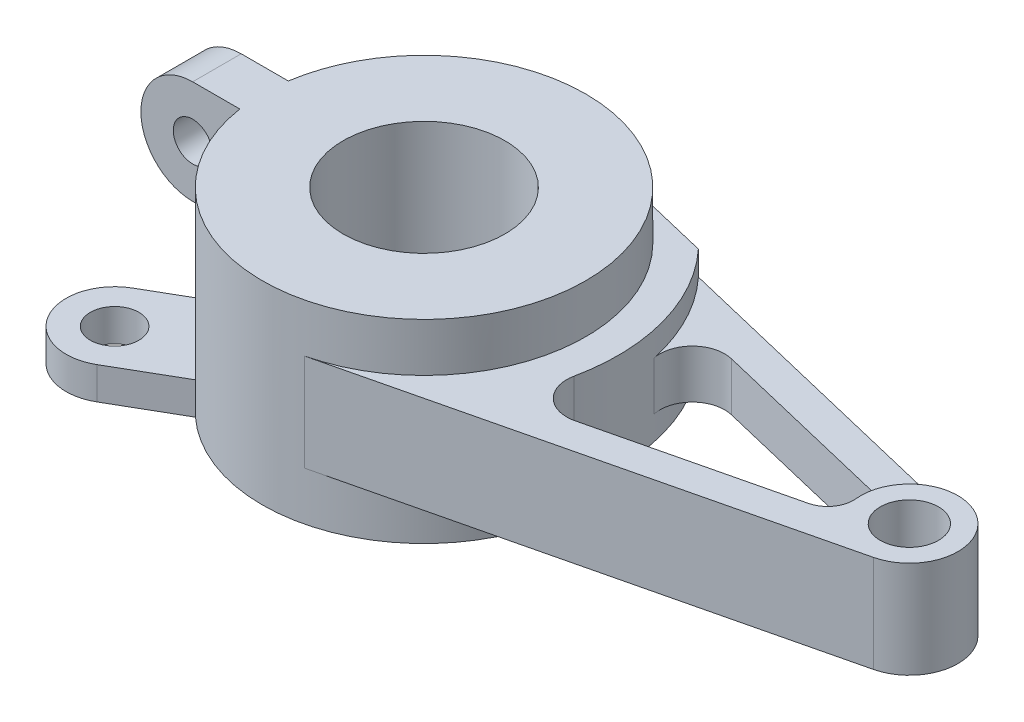
ISO-10303-21;
HEADER;
FILE_DESCRIPTION(('STEP AP214'),'2;1');
FILE_NAME('part.step','',(''),(''),'','','');
FILE_SCHEMA(('AUTOMOTIVE_DESIGN { 1 0 10303 214 1 1 1 1 }'));
ENDSEC;
DATA;
#1=APPLICATION_CONTEXT('core data for automotive mechanical design processes');
#2=APPLICATION_PROTOCOL_DEFINITION('international standard','automotive_design',2000,#1);
#3=PRODUCT_CONTEXT('',#1,'mechanical');
#4=PRODUCT('Part','Part','',(#3));
#5=PRODUCT_RELATED_PRODUCT_CATEGORY('part','',(#4));
#6=PRODUCT_DEFINITION_FORMATION('','',#4);
#7=PRODUCT_DEFINITION_CONTEXT('part definition',#1,'design');
#8=PRODUCT_DEFINITION('design','',#6,#7);
#9=PRODUCT_DEFINITION_SHAPE('','',#8);
#10=(LENGTH_UNIT() NAMED_UNIT(*) SI_UNIT(.MILLI.,.METRE.));
#11=(NAMED_UNIT(*) PLANE_ANGLE_UNIT() SI_UNIT($,.RADIAN.));
#12=(NAMED_UNIT(*) SI_UNIT($,.STERADIAN.) SOLID_ANGLE_UNIT());
#13=UNCERTAINTY_MEASURE_WITH_UNIT(LENGTH_MEASURE(1.E-05),#10,'distance_accuracy_value','');
#14=(GEOMETRIC_REPRESENTATION_CONTEXT(3) GLOBAL_UNCERTAINTY_ASSIGNED_CONTEXT((#13)) GLOBAL_UNIT_ASSIGNED_CONTEXT((#10,
#11,#12)) REPRESENTATION_CONTEXT('',''));
#15=CARTESIAN_POINT('',(0.,0.,0.));
#16=DIRECTION('',(0.,0.,1.));
#17=DIRECTION('',(1.,0.,0.));
#18=AXIS2_PLACEMENT_3D('',#15,#16,#17);
#19=CARTESIAN_POINT('',(-64.,14.,7.5));
#20=DIRECTION('',(0.,0.,1.));
#21=DIRECTION('',(0.,-1.,0.));
#22=AXIS2_PLACEMENT_3D('',#19,#20,#21);
#23=CYLINDRICAL_SURFACE('',#22,16.);
#24=DIRECTION('',(0.,0.,-1.));
#25=VECTOR('',#24,1.);
#26=CARTESIAN_POINT('',(-64.,-2.,7.5));
#27=LINE('',#26,#25);
#28=CARTESIAN_POINT('',(-64.,-2.,7.5));
#29=VERTEX_POINT('',#28);
#30=CARTESIAN_POINT('',(-64.,-2.,-7.50000000000001));
#31=VERTEX_POINT('',#30);
#32=EDGE_CURVE('E430',#29,#31,#27,.T.);
#33=ORIENTED_EDGE('',*,*,#32,.F.);
#34=CARTESIAN_POINT('',(-64.,14.,7.5));
#35=DIRECTION('',(0.,0.,-1.));
#36=DIRECTION('',(0.,1.,0.));
#37=AXIS2_PLACEMENT_3D('',#34,#35,#36);
#38=CIRCLE('',#37,16.);
#39=CARTESIAN_POINT('',(-64.,30.,7.5));
#40=VERTEX_POINT('',#39);
#41=EDGE_CURVE('E47',#40,#29,#38,.F.);
#42=ORIENTED_EDGE('',*,*,#41,.F.);
#43=DIRECTION('',(0.,0.,-1.));
#44=VECTOR('',#43,1.);
#45=CARTESIAN_POINT('',(-64.,30.,7.5));
#46=LINE('',#45,#44);
#47=CARTESIAN_POINT('',(-64.,30.,-7.5));
#48=VERTEX_POINT('',#47);
#49=EDGE_CURVE('E434',#48,#40,#46,.F.);
#50=ORIENTED_EDGE('',*,*,#49,.F.);
#51=CARTESIAN_POINT('',(-64.,14.,-7.5));
#52=DIRECTION('',(0.,0.,-1.));
#53=DIRECTION('',(0.,1.,0.));
#54=AXIS2_PLACEMENT_3D('',#51,#52,#53);
#55=CIRCLE('',#54,16.);
#56=EDGE_CURVE('E11',#31,#48,#55,.T.);
#57=ORIENTED_EDGE('',*,*,#56,.F.);
#58=EDGE_LOOP('',(#33,#42,#50,#57));
#59=FACE_BOUND('',#58,.T.);
#60=ADVANCED_FACE('F38',(#59),#23,.T.);
#61=CARTESIAN_POINT('',(0.,30.,0.));
#62=DIRECTION('',(0.,-1.,0.));
#63=DIRECTION('',(0.,0.,-1.));
#64=AXIS2_PLACEMENT_3D('',#61,#62,#63);
#65=CYLINDRICAL_SURFACE('',#64,50.);
#66=DIRECTION('',(0.,-1.,0.));
#67=VECTOR('',#66,1.);
#68=CARTESIAN_POINT('',(-48.8067791046457,-20.,-10.8580989786571));
#69=LINE('',#68,#67);
#70=CARTESIAN_POINT('',(-48.8067791046457,-20.,-10.8580989786571));
#71=VERTEX_POINT('',#70);
#72=CARTESIAN_POINT('',(-48.8067791046458,-30.,-10.8580989786571));
#73=VERTEX_POINT('',#72);
#74=EDGE_CURVE('E268',#71,#73,#69,.T.);
#75=ORIENTED_EDGE('',*,*,#74,.T.);
#76=CARTESIAN_POINT('',(0.,-30.,0.));
#77=DIRECTION('',(0.,1.,0.));
#78=DIRECTION('',(0.,0.,1.));
#79=AXIS2_PLACEMENT_3D('',#76,#77,#78);
#80=CIRCLE('',#79,50.);
#81=CARTESIAN_POINT('',(-48.8067791046457,-30.,10.8580989786571));
#82=VERTEX_POINT('',#81);
#83=EDGE_CURVE('E426',#73,#82,#80,.T.);
#84=ORIENTED_EDGE('',*,*,#83,.T.);
#85=DIRECTION('',(0.,-1.,0.));
#86=VECTOR('',#85,1.);
#87=CARTESIAN_POINT('',(-48.8067791046457,-20.,10.8580989786571));
#88=LINE('',#87,#86);
#89=CARTESIAN_POINT('',(-48.8067791046458,-20.,10.8580989786571));
#90=VERTEX_POINT('',#89);
#91=EDGE_CURVE('E307',#90,#82,#88,.T.);
#92=ORIENTED_EDGE('',*,*,#91,.F.);
#93=CARTESIAN_POINT('',(0.,-20.,0.));
#94=DIRECTION('',(0.,1.,0.));
#95=DIRECTION('',(0.,0.,-1.));
#96=AXIS2_PLACEMENT_3D('',#93,#94,#95);
#97=CIRCLE('',#96,50.);
#98=CARTESIAN_POINT('',(-33.8067791046457,-20.,36.8388610921903));
#99=VERTEX_POINT('',#98);
#100=EDGE_CURVE('E288',#90,#99,#97,.T.);
#101=ORIENTED_EDGE('',*,*,#100,.T.);
#102=DIRECTION('',(0.,-1.,0.));
#103=VECTOR('',#102,1.);
#104=CARTESIAN_POINT('',(-33.8067791046457,-20.,36.8388610921903));
#105=LINE('',#104,#103);
#106=CARTESIAN_POINT('',(-33.8067791046457,-30.,36.8388610921903));
#107=VERTEX_POINT('',#106);
#108=EDGE_CURVE('E304',#99,#107,#105,.T.);
#109=ORIENTED_EDGE('',*,*,#108,.T.);
#110=CARTESIAN_POINT('',(-33.8067791046457,-30.,-36.8388610921903));
#111=VERTEX_POINT('',#110);
#112=EDGE_CURVE('E431',#107,#111,#80,.T.);
#113=ORIENTED_EDGE('',*,*,#112,.T.);
#114=DIRECTION('',(0.,-1.,0.));
#115=VECTOR('',#114,1.);
#116=CARTESIAN_POINT('',(-33.8067791046457,-20.,-36.8388610921903));
#117=LINE('',#116,#115);
#118=CARTESIAN_POINT('',(-33.8067791046457,-20.,-36.8388610921903));
#119=VERTEX_POINT('',#118);
#120=EDGE_CURVE('E270',#119,#111,#117,.T.);
#121=ORIENTED_EDGE('',*,*,#120,.F.);
#122=CARTESIAN_POINT('',(0.,-20.,0.));
#123=DIRECTION('',(0.,-1.,0.));
#124=DIRECTION('',(0.,0.,1.));
#125=AXIS2_PLACEMENT_3D('',#122,#123,#124);
#126=CIRCLE('',#125,50.);
#127=EDGE_CURVE('E251',#71,#119,#126,.T.);
#128=ORIENTED_EDGE('',*,*,#127,.F.);
#129=EDGE_LOOP('',(#75,#84,#92,#101,#109,#113,#121,#128));
#130=FACE_BOUND('',#129,.T.);
#131=CARTESIAN_POINT('',(0.,15.,0.));
#132=DIRECTION('',(0.,-1.,0.));
#133=DIRECTION('',(0.,0.,1.));
#134=AXIS2_PLACEMENT_3D('',#131,#132,#133);
#135=CIRCLE('',#134,50.);
#136=CARTESIAN_POINT('',(11.6666666666667,15.,-48.6198404860494));
#137=VERTEX_POINT('',#136);
#138=CARTESIAN_POINT('',(11.6666666666667,15.,48.6198404860494));
#139=VERTEX_POINT('',#138);
#140=EDGE_CURVE('E370',#137,#139,#135,.T.);
#141=ORIENTED_EDGE('',*,*,#140,.F.);
#142=DIRECTION('',(0.,-1.,0.));
#143=VECTOR('',#142,1.);
#144=CARTESIAN_POINT('',(11.6666666666667,15.,-48.6198404860494));
#145=LINE('',#144,#143);
#146=CARTESIAN_POINT('',(11.6666666666667,-15.,-48.6198404860494));
#147=VERTEX_POINT('',#146);
#148=EDGE_CURVE('E413',#137,#147,#145,.T.);
#149=ORIENTED_EDGE('',*,*,#148,.T.);
#150=CARTESIAN_POINT('',(0.,-15.,0.));
#151=DIRECTION('',(0.,-1.,0.));
#152=DIRECTION('',(0.,0.,1.));
#153=AXIS2_PLACEMENT_3D('',#150,#151,#152);
#154=CIRCLE('',#153,50.);
#155=CARTESIAN_POINT('',(11.6666666666667,-15.,48.6198404860494));
#156=VERTEX_POINT('',#155);
#157=EDGE_CURVE('E390',#147,#156,#154,.T.);
#158=ORIENTED_EDGE('',*,*,#157,.T.);
#159=DIRECTION('',(0.,-1.,0.));
#160=VECTOR('',#159,1.);
#161=CARTESIAN_POINT('',(11.6666666666667,15.,48.6198404860494));
#162=LINE('',#161,#160);
#163=EDGE_CURVE('E410',#139,#156,#162,.T.);
#164=ORIENTED_EDGE('',*,*,#163,.F.);
#165=EDGE_LOOP('',(#141,#149,#158,#164));
#166=FACE_BOUND('',#165,.T.);
#167=DIRECTION('',(0.,-1.,0.));
#168=VECTOR('',#167,1.);
#169=CARTESIAN_POINT('',(-49.434299833213,30.,7.5));
#170=LINE('',#169,#168);
#171=CARTESIAN_POINT('',(-49.434299833213,30.,7.5));
#172=VERTEX_POINT('',#171);
#173=CARTESIAN_POINT('',(-49.434299833213,-2.,7.5));
#174=VERTEX_POINT('',#173);
#175=EDGE_CURVE('E220',#172,#174,#170,.T.);
#176=ORIENTED_EDGE('',*,*,#175,.T.);
#177=CARTESIAN_POINT('',(0.,-2.,0.));
#178=DIRECTION('',(0.,-1.,0.));
#179=DIRECTION('',(0.,0.,-1.));
#180=AXIS2_PLACEMENT_3D('',#177,#178,#179);
#181=CIRCLE('',#180,50.);
#182=CARTESIAN_POINT('',(-49.434299833213,-2.,-7.50000000000001));
#183=VERTEX_POINT('',#182);
#184=EDGE_CURVE('E210',#183,#174,#181,.F.);
#185=ORIENTED_EDGE('',*,*,#184,.F.);
#186=DIRECTION('',(0.,-1.,0.));
#187=VECTOR('',#186,1.);
#188=CARTESIAN_POINT('',(-49.434299833213,30.,-7.5));
#189=LINE('',#188,#187);
#190=CARTESIAN_POINT('',(-49.434299833213,30.,-7.5));
#191=VERTEX_POINT('',#190);
#192=EDGE_CURVE('E219',#191,#183,#189,.T.);
#193=ORIENTED_EDGE('',*,*,#192,.F.);
#194=CARTESIAN_POINT('',(0.,30.,0.));
#195=DIRECTION('',(0.,1.,0.));
#196=DIRECTION('',(0.,0.,1.));
#197=AXIS2_PLACEMENT_3D('',#194,#195,#196);
#198=CIRCLE('',#197,50.);
#199=EDGE_CURVE('E231',#172,#191,#198,.T.);
#200=ORIENTED_EDGE('',*,*,#199,.F.);
#201=EDGE_LOOP('',(#176,#185,#193,#200));
#202=FACE_BOUND('',#201,.T.);
#203=ADVANCED_FACE('F229',(#130,#166,#202),#65,.T.);
#204=CARTESIAN_POINT('',(0.,30.,0.));
#205=DIRECTION('',(0.,1.,0.));
#206=DIRECTION('',(0.,0.,1.));
#207=AXIS2_PLACEMENT_3D('',#204,#205,#206);
#208=PLANE('',#207);
#209=DIRECTION('',(-1.,0.,0.));
#210=VECTOR('',#209,1.);
#211=CARTESIAN_POINT('',(165.002,30.,-7.5));
#212=LINE('',#211,#210);
#213=EDGE_CURVE('E244',#191,#48,#212,.T.);
#214=ORIENTED_EDGE('',*,*,#213,.T.);
#215=ORIENTED_EDGE('',*,*,#49,.T.);
#216=DIRECTION('',(-1.,0.,0.));
#217=VECTOR('',#216,1.);
#218=CARTESIAN_POINT('',(165.002,30.,7.5));
#219=LINE('',#218,#217);
#220=EDGE_CURVE('E227',#172,#40,#219,.T.);
#221=ORIENTED_EDGE('',*,*,#220,.F.);
#222=ORIENTED_EDGE('',*,*,#199,.T.);
#223=EDGE_LOOP('',(#214,#215,#221,#222));
#224=FACE_BOUND('',#223,.T.);
#225=CARTESIAN_POINT('',(0.,30.,0.));
#226=DIRECTION('',(0.,1.,0.));
#227=DIRECTION('',(0.,0.,1.));
#228=AXIS2_PLACEMENT_3D('',#225,#226,#227);
#229=CIRCLE('',#228,25.);
#230=CARTESIAN_POINT('',(0.,30.,25.));
#231=VERTEX_POINT('',#230);
#232=EDGE_CURVE('E423',#231,#231,#229,.T.);
#233=ORIENTED_EDGE('',*,*,#232,.F.);
#234=EDGE_LOOP('',(#233));
#235=FACE_BOUND('',#234,.T.);
#236=ADVANCED_FACE('F438',(#224,#235),#208,.T.);
#237=CARTESIAN_POINT('',(0.,-30.,0.));
#238=DIRECTION('',(0.,1.,0.));
#239=DIRECTION('',(0.,0.,1.));
#240=AXIS2_PLACEMENT_3D('',#237,#238,#239);
#241=PLANE('',#240);
#242=ORIENTED_EDGE('',*,*,#112,.F.);
#243=DIRECTION('',(-0.866025403784438,0.,0.500000000000001));
#244=VECTOR('',#243,1.);
#245=CARTESIAN_POINT('',(-53.1217782649107,-30.,47.9903810567666));
#246=LINE('',#245,#244);
#247=CARTESIAN_POINT('',(-53.1217782649107,-30.,47.9903810567666));
#248=VERTEX_POINT('',#247);
#249=EDGE_CURVE('E285',#107,#248,#246,.T.);
#250=ORIENTED_EDGE('',*,*,#249,.T.);
#251=CARTESIAN_POINT('',(-60.6217782649107,-30.,35.0000000000001));
#252=DIRECTION('',(0.,-1.,0.));
#253=DIRECTION('',(0.,0.,-1.));
#254=AXIS2_PLACEMENT_3D('',#251,#252,#253);
#255=CIRCLE('',#254,15.);
#256=CARTESIAN_POINT('',(-68.1217782649107,-30.,22.0096189432335));
#257=VERTEX_POINT('',#256);
#258=EDGE_CURVE('E278',#248,#257,#255,.T.);
#259=ORIENTED_EDGE('',*,*,#258,.T.);
#260=DIRECTION('',(0.866025403784438,0.,-0.500000000000001));
#261=VECTOR('',#260,1.);
#262=CARTESIAN_POINT('',(-68.1217782649107,-30.,22.0096189432335));
#263=LINE('',#262,#261);
#264=EDGE_CURVE('E296',#257,#82,#263,.T.);
#265=ORIENTED_EDGE('',*,*,#264,.T.);
#266=ORIENTED_EDGE('',*,*,#83,.F.);
#267=DIRECTION('',(0.866025403784438,0.,0.500000000000001));
#268=VECTOR('',#267,1.);
#269=CARTESIAN_POINT('',(-68.1217782649107,-30.,-22.0096189432335));
#270=LINE('',#269,#268);
#271=CARTESIAN_POINT('',(-68.1217782649107,-30.,-22.0096189432335));
#272=VERTEX_POINT('',#271);
#273=EDGE_CURVE('E249',#272,#73,#270,.T.);
#274=ORIENTED_EDGE('',*,*,#273,.F.);
#275=CARTESIAN_POINT('',(-60.6217782649107,-30.,-35.0000000000001));
#276=DIRECTION('',(0.,1.,0.));
#277=DIRECTION('',(0.,0.,1.));
#278=AXIS2_PLACEMENT_3D('',#275,#276,#277);
#279=CIRCLE('',#278,15.);
#280=CARTESIAN_POINT('',(-53.1217782649107,-30.,-47.9903810567666));
#281=VERTEX_POINT('',#280);
#282=EDGE_CURVE('E240',#281,#272,#279,.T.);
#283=ORIENTED_EDGE('',*,*,#282,.F.);
#284=DIRECTION('',(-0.866025403784438,0.,-0.500000000000001));
#285=VECTOR('',#284,1.);
#286=CARTESIAN_POINT('',(-53.1217782649107,-30.,-47.9903810567666));
#287=LINE('',#286,#285);
#288=EDGE_CURVE('E260',#111,#281,#287,.T.);
#289=ORIENTED_EDGE('',*,*,#288,.F.);
#290=EDGE_LOOP('',(#242,#250,#259,#265,#266,#274,#283,#289));
#291=FACE_BOUND('',#290,.T.);
#292=CARTESIAN_POINT('',(0.,-30.,0.));
#293=DIRECTION('',(0.,1.,0.));
#294=DIRECTION('',(0.,0.,1.));
#295=AXIS2_PLACEMENT_3D('',#292,#293,#294);
#296=CIRCLE('',#295,25.);
#297=CARTESIAN_POINT('',(0.,-30.,25.));
#298=VERTEX_POINT('',#297);
#299=EDGE_CURVE('E422',#298,#298,#296,.T.);
#300=ORIENTED_EDGE('',*,*,#299,.T.);
#301=EDGE_LOOP('',(#300));
#302=FACE_BOUND('',#301,.T.);
#303=CARTESIAN_POINT('',(-60.6217782649107,-30.,35.0000000000001));
#304=DIRECTION('',(0.,-1.,0.));
#305=DIRECTION('',(0.,0.,-1.));
#306=AXIS2_PLACEMENT_3D('',#303,#304,#305);
#307=CIRCLE('',#306,7.50000000000001);
#308=CARTESIAN_POINT('',(-60.6217782649107,-30.,27.5));
#309=VERTEX_POINT('',#308);
#310=EDGE_CURVE('E267',#309,#309,#307,.T.);
#311=ORIENTED_EDGE('',*,*,#310,.F.);
#312=EDGE_LOOP('',(#311));
#313=FACE_BOUND('',#312,.T.);
#314=CARTESIAN_POINT('',(-60.6217782649107,-30.,-35.0000000000001));
#315=DIRECTION('',(0.,1.,0.));
#316=DIRECTION('',(0.,0.,1.));
#317=AXIS2_PLACEMENT_3D('',#314,#315,#316);
#318=CIRCLE('',#317,7.50000000000001);
#319=CARTESIAN_POINT('',(-60.6217782649107,-30.,-27.5));
#320=VERTEX_POINT('',#319);
#321=EDGE_CURVE('E241',#320,#320,#318,.T.);
#322=ORIENTED_EDGE('',*,*,#321,.T.);
#323=EDGE_LOOP('',(#322));
#324=FACE_BOUND('',#323,.T.);
#325=ADVANCED_FACE('F471',(#291,#302,#313,#324),#241,.F.);
#326=CARTESIAN_POINT('',(0.,30.,0.));
#327=DIRECTION('',(0.,-1.,0.));
#328=DIRECTION('',(0.,0.,-1.));
#329=AXIS2_PLACEMENT_3D('',#326,#327,#328);
#330=CYLINDRICAL_SURFACE('',#329,25.);
#331=ORIENTED_EDGE('',*,*,#232,.T.);
#332=EDGE_LOOP('',(#331));
#333=FACE_BOUND('',#332,.T.);
#334=ORIENTED_EDGE('',*,*,#299,.F.);
#335=EDGE_LOOP('',(#334));
#336=FACE_BOUND('',#335,.T.);
#337=ADVANCED_FACE('F476',(#333,#336),#330,.F.);
#338=CARTESIAN_POINT('',(68.4997741639936,15.,14.4146085441772));
#339=DIRECTION('',(0.,1.,0.));
#340=DIRECTION('',(0.,0.,1.));
#341=AXIS2_PLACEMENT_3D('',#338,#339,#340);
#342=PLANE('',#341);
#343=CARTESIAN_POINT('',(68.4997741639936,15.,14.4146085441772));
#344=DIRECTION('',(0.,-1.,0.));
#345=DIRECTION('',(0.,0.,1.));
#346=AXIS2_PLACEMENT_3D('',#343,#344,#345);
#347=CIRCLE('',#346,9.99999999999999);
#348=CARTESIAN_POINT('',(70.833107497327,15.,24.1385766413871));
#349=VERTEX_POINT('',#348);
#350=CARTESIAN_POINT('',(58.714092140566,15.,12.3553787521519));
#351=VERTEX_POINT('',#350);
#352=EDGE_CURVE('E361',#349,#351,#347,.T.);
#353=ORIENTED_EDGE('',*,*,#352,.T.);
#354=CARTESIAN_POINT('',(0.,15.,0.));
#355=DIRECTION('',(0.,1.,0.));
#356=DIRECTION('',(0.,0.,1.));
#357=AXIS2_PLACEMENT_3D('',#354,#355,#356);
#358=CIRCLE('',#357,60.);
#359=CARTESIAN_POINT('',(43.917420318498,15.,-40.8810493085535));
#360=VERTEX_POINT('',#359);
#361=EDGE_CURVE('E364',#351,#360,#358,.T.);
#362=ORIENTED_EDGE('',*,*,#361,.T.);
#363=DIRECTION('',(-0.972396809720988,0.,-0.233333333333333));
#364=VECTOR('',#363,1.);
#365=CARTESIAN_POINT('',(43.917420318498,15.,-40.8810493085535));
#366=LINE('',#365,#364);
#367=EDGE_CURVE('E367',#360,#137,#366,.T.);
#368=ORIENTED_EDGE('',*,*,#367,.T.);
#369=ORIENTED_EDGE('',*,*,#140,.T.);
#370=DIRECTION('',(0.972396809720988,0.,-0.233333333333333));
#371=VECTOR('',#370,1.);
#372=CARTESIAN_POINT('',(153.5,15.,14.5859521458148));
#373=LINE('',#372,#371);
#374=CARTESIAN_POINT('',(153.5,15.,14.5859521458148));
#375=VERTEX_POINT('',#374);
#376=EDGE_CURVE('E373',#139,#375,#373,.T.);
#377=ORIENTED_EDGE('',*,*,#376,.T.);
#378=CARTESIAN_POINT('',(150.,15.,0.));
#379=DIRECTION('',(0.,1.,0.));
#380=DIRECTION('',(0.,0.,1.));
#381=AXIS2_PLACEMENT_3D('',#378,#379,#380);
#382=CIRCLE('',#381,15.);
#383=CARTESIAN_POINT('',(135.082135488409,15.,1.56758362258675));
#384=VERTEX_POINT('',#383);
#385=EDGE_CURVE('E375',#375,#384,#382,.T.);
#386=ORIENTED_EDGE('',*,*,#385,.T.);
#387=CARTESIAN_POINT('',(127.125941082227,15.,2.40362822129968));
#388=DIRECTION('',(0.,-1.,0.));
#389=DIRECTION('',(0.,0.,1.));
#390=AXIS2_PLACEMENT_3D('',#387,#388,#389);
#391=CIRCLE('',#390,8.00000000000001);
#392=CARTESIAN_POINT('',(128.992607748893,15.,10.1828026990676));
#393=VERTEX_POINT('',#392);
#394=EDGE_CURVE('E377',#384,#393,#391,.T.);
#395=ORIENTED_EDGE('',*,*,#394,.T.);
#396=DIRECTION('',(-0.972396809720988,0.,0.233333333333333));
#397=VECTOR('',#396,1.);
#398=CARTESIAN_POINT('',(128.992607748893,15.,10.1828026990676));
#399=LINE('',#398,#397);
#400=EDGE_CURVE('E379',#393,#349,#399,.T.);
#401=ORIENTED_EDGE('',*,*,#400,.T.);
#402=EDGE_LOOP('',(#353,#362,#368,#369,#377,#386,#395,#401));
#403=FACE_BOUND('',#402,.T.);
#404=CARTESIAN_POINT('',(150.,15.,0.));
#405=DIRECTION('',(0.,1.,0.));
#406=DIRECTION('',(0.,0.,1.));
#407=AXIS2_PLACEMENT_3D('',#404,#405,#406);
#408=CIRCLE('',#407,9.00000000000001);
#409=CARTESIAN_POINT('',(150.,15.,9.00000000000001));
#410=VERTEX_POINT('',#409);
#411=EDGE_CURVE('E355',#410,#410,#408,.T.);
#412=ORIENTED_EDGE('',*,*,#411,.F.);
#413=EDGE_LOOP('',(#412));
#414=FACE_BOUND('',#413,.T.);
#415=ADVANCED_FACE('F481',(#403,#414),#342,.T.);
#416=CARTESIAN_POINT('',(68.4997741639936,-15.,14.4146085441772));
#417=DIRECTION('',(0.,1.,0.));
#418=DIRECTION('',(0.,0.,1.));
#419=AXIS2_PLACEMENT_3D('',#416,#417,#418);
#420=PLANE('',#419);
#421=CARTESIAN_POINT('',(68.4997741639936,-15.,14.4146085441772));
#422=DIRECTION('',(0.,-1.,0.));
#423=DIRECTION('',(0.,0.,1.));
#424=AXIS2_PLACEMENT_3D('',#421,#422,#423);
#425=CIRCLE('',#424,9.99999999999999);
#426=CARTESIAN_POINT('',(70.833107497327,-15.,24.1385766413871));
#427=VERTEX_POINT('',#426);
#428=CARTESIAN_POINT('',(58.714092140566,-15.,12.3553787521519));
#429=VERTEX_POINT('',#428);
#430=EDGE_CURVE('E358',#427,#429,#425,.T.);
#431=ORIENTED_EDGE('',*,*,#430,.F.);
#432=DIRECTION('',(-0.972396809720988,0.,0.233333333333333));
#433=VECTOR('',#432,1.);
#434=CARTESIAN_POINT('',(128.992607748893,-15.,10.1828026990676));
#435=LINE('',#434,#433);
#436=CARTESIAN_POINT('',(128.992607748893,-15.,10.1828026990676));
#437=VERTEX_POINT('',#436);
#438=EDGE_CURVE('E365',#437,#427,#435,.T.);
#439=ORIENTED_EDGE('',*,*,#438,.F.);
#440=CARTESIAN_POINT('',(127.125941082227,-15.,2.40362822129968));
#441=DIRECTION('',(0.,-1.,0.));
#442=DIRECTION('',(0.,0.,1.));
#443=AXIS2_PLACEMENT_3D('',#440,#441,#442);
#444=CIRCLE('',#443,8.00000000000001);
#445=CARTESIAN_POINT('',(135.082135488409,-15.,1.56758362258675));
#446=VERTEX_POINT('',#445);
#447=EDGE_CURVE('E396',#446,#437,#444,.T.);
#448=ORIENTED_EDGE('',*,*,#447,.F.);
#449=CARTESIAN_POINT('',(150.,-15.,0.));
#450=DIRECTION('',(0.,1.,0.));
#451=DIRECTION('',(0.,0.,1.));
#452=AXIS2_PLACEMENT_3D('',#449,#450,#451);
#453=CIRCLE('',#452,15.);
#454=CARTESIAN_POINT('',(153.5,-15.,14.5859521458148));
#455=VERTEX_POINT('',#454);
#456=EDGE_CURVE('E394',#455,#446,#453,.T.);
#457=ORIENTED_EDGE('',*,*,#456,.F.);
#458=DIRECTION('',(0.972396809720988,0.,-0.233333333333333));
#459=VECTOR('',#458,1.);
#460=CARTESIAN_POINT('',(153.5,-15.,14.5859521458148));
#461=LINE('',#460,#459);
#462=EDGE_CURVE('E392',#156,#455,#461,.T.);
#463=ORIENTED_EDGE('',*,*,#462,.F.);
#464=ORIENTED_EDGE('',*,*,#157,.F.);
#465=DIRECTION('',(-0.972396809720988,0.,-0.233333333333333));
#466=VECTOR('',#465,1.);
#467=CARTESIAN_POINT('',(43.917420318498,-15.,-40.8810493085535));
#468=LINE('',#467,#466);
#469=CARTESIAN_POINT('',(43.917420318498,-15.,-40.8810493085535));
#470=VERTEX_POINT('',#469);
#471=EDGE_CURVE('E387',#470,#147,#468,.T.);
#472=ORIENTED_EDGE('',*,*,#471,.F.);
#473=CARTESIAN_POINT('',(0.,-15.,0.));
#474=DIRECTION('',(0.,1.,0.));
#475=DIRECTION('',(0.,0.,1.));
#476=AXIS2_PLACEMENT_3D('',#473,#474,#475);
#477=CIRCLE('',#476,60.);
#478=EDGE_CURVE('E384',#429,#470,#477,.T.);
#479=ORIENTED_EDGE('',*,*,#478,.F.);
#480=EDGE_LOOP('',(#431,#439,#448,#457,#463,#464,#472,#479));
#481=FACE_BOUND('',#480,.T.);
#482=CARTESIAN_POINT('',(150.,-15.,0.));
#483=DIRECTION('',(0.,1.,0.));
#484=DIRECTION('',(0.,0.,1.));
#485=AXIS2_PLACEMENT_3D('',#482,#483,#484);
#486=CIRCLE('',#485,9.00000000000001);
#487=CARTESIAN_POINT('',(150.,-15.,9.00000000000001));
#488=VERTEX_POINT('',#487);
#489=EDGE_CURVE('E354',#488,#488,#486,.T.);
#490=ORIENTED_EDGE('',*,*,#489,.T.);
#491=EDGE_LOOP('',(#490));
#492=FACE_BOUND('',#491,.T.);
#493=ADVANCED_FACE('F487',(#481,#492),#420,.F.);
#494=CARTESIAN_POINT('',(68.4997741639936,15.,14.4146085441772));
#495=DIRECTION('',(0.,-1.,0.));
#496=DIRECTION('',(0.,0.,-1.));
#497=AXIS2_PLACEMENT_3D('',#494,#495,#496);
#498=CYLINDRICAL_SURFACE('',#497,9.99999999999999);
#499=ORIENTED_EDGE('',*,*,#430,.T.);
#500=DIRECTION('',(0.,-1.,0.));
#501=VECTOR('',#500,1.);
#502=CARTESIAN_POINT('',(58.714092140566,15.,12.3553787521519));
#503=LINE('',#502,#501);
#504=EDGE_CURVE('E419',#351,#429,#503,.T.);
#505=ORIENTED_EDGE('',*,*,#504,.F.);
#506=ORIENTED_EDGE('',*,*,#352,.F.);
#507=DIRECTION('',(0.,-1.,0.));
#508=VECTOR('',#507,1.);
#509=CARTESIAN_POINT('',(70.833107497327,15.,24.1385766413871));
#510=LINE('',#509,#508);
#511=EDGE_CURVE('E381',#349,#427,#510,.T.);
#512=ORIENTED_EDGE('',*,*,#511,.T.);
#513=EDGE_LOOP('',(#499,#505,#506,#512));
#514=FACE_BOUND('',#513,.T.);
#515=ADVANCED_FACE('F483',(#514),#498,.F.);
#516=CARTESIAN_POINT('',(0.,15.,0.));
#517=DIRECTION('',(0.,-1.,0.));
#518=DIRECTION('',(0.,0.,-1.));
#519=AXIS2_PLACEMENT_3D('',#516,#517,#518);
#520=CYLINDRICAL_SURFACE('',#519,60.);
#521=DIRECTION('',(0.,-1.,0.));
#522=VECTOR('',#521,1.);
#523=CARTESIAN_POINT('',(58.714092140566,7.5,-12.3553787521519));
#524=LINE('',#523,#522);
#525=CARTESIAN_POINT('',(58.714092140566,7.5,-12.3553787521519));
#526=VERTEX_POINT('',#525);
#527=CARTESIAN_POINT('',(58.714092140566,-7.5,-12.3553787521519));
#528=VERTEX_POINT('',#527);
#529=EDGE_CURVE('E351',#526,#528,#524,.T.);
#530=ORIENTED_EDGE('',*,*,#529,.F.);
#531=CARTESIAN_POINT('',(0.,7.5,0.));
#532=DIRECTION('',(0.,-1.,0.));
#533=DIRECTION('',(0.,0.,1.));
#534=AXIS2_PLACEMENT_3D('',#531,#532,#533);
#535=CIRCLE('',#534,60.);
#536=CARTESIAN_POINT('',(43.917420318498,7.5,-40.8810493085535));
#537=VERTEX_POINT('',#536);
#538=EDGE_CURVE('E311',#537,#526,#535,.T.);
#539=ORIENTED_EDGE('',*,*,#538,.F.);
#540=DIRECTION('',(0.,-1.,0.));
#541=VECTOR('',#540,1.);
#542=CARTESIAN_POINT('',(43.917420318498,15.,-40.8810493085535));
#543=LINE('',#542,#541);
#544=EDGE_CURVE('E416',#360,#537,#543,.T.);
#545=ORIENTED_EDGE('',*,*,#544,.F.);
#546=ORIENTED_EDGE('',*,*,#361,.F.);
#547=ORIENTED_EDGE('',*,*,#504,.T.);
#548=ORIENTED_EDGE('',*,*,#478,.T.);
#549=CARTESIAN_POINT('',(43.917420318498,-7.5,-40.8810493085535));
#550=VERTEX_POINT('',#549);
#551=EDGE_CURVE('E415',#550,#470,#543,.T.);
#552=ORIENTED_EDGE('',*,*,#551,.F.);
#553=CARTESIAN_POINT('',(0.,-7.5,0.));
#554=DIRECTION('',(0.,-1.,0.));
#555=DIRECTION('',(0.,0.,1.));
#556=AXIS2_PLACEMENT_3D('',#553,#554,#555);
#557=CIRCLE('',#556,60.);
#558=EDGE_CURVE('E303',#550,#528,#557,.T.);
#559=ORIENTED_EDGE('',*,*,#558,.T.);
#560=EDGE_LOOP('',(#530,#539,#545,#546,#547,#548,#552,#559));
#561=FACE_BOUND('',#560,.T.);
#562=ADVANCED_FACE('F486',(#561),#520,.T.);
#563=CARTESIAN_POINT('',(43.917420318498,15.,-40.8810493085535));
#564=DIRECTION('',(-0.233333333333333,0.,0.972396809720988));
#565=DIRECTION('',(0.972396809720988,0.,0.233333333333333));
#566=AXIS2_PLACEMENT_3D('',#563,#564,#565);
#567=PLANE('',#566);
#568=ORIENTED_EDGE('',*,*,#471,.T.);
#569=ORIENTED_EDGE('',*,*,#148,.F.);
#570=ORIENTED_EDGE('',*,*,#367,.F.);
#571=ORIENTED_EDGE('',*,*,#544,.T.);
#572=DIRECTION('',(-0.972396809720988,0.,-0.233333333333333));
#573=VECTOR('',#572,1.);
#574=CARTESIAN_POINT('',(43.917420318498,7.5,-40.8810493085535));
#575=LINE('',#574,#573);
#576=CARTESIAN_POINT('',(153.5,7.5,-14.5859521458148));
#577=VERTEX_POINT('',#576);
#578=EDGE_CURVE('E325',#577,#537,#575,.T.);
#579=ORIENTED_EDGE('',*,*,#578,.F.);
#580=DIRECTION('',(0.,-1.,0.));
#581=VECTOR('',#580,1.);
#582=CARTESIAN_POINT('',(153.5,7.5,-14.5859521458148));
#583=LINE('',#582,#581);
#584=CARTESIAN_POINT('',(153.5,-7.5,-14.5859521458148));
#585=VERTEX_POINT('',#584);
#586=EDGE_CURVE('E327',#577,#585,#583,.T.);
#587=ORIENTED_EDGE('',*,*,#586,.T.);
#588=DIRECTION('',(-0.972396809720988,0.,-0.233333333333333));
#589=VECTOR('',#588,1.);
#590=CARTESIAN_POINT('',(43.917420318498,-7.5,-40.8810493085535));
#591=LINE('',#590,#589);
#592=EDGE_CURVE('E315',#585,#550,#591,.T.);
#593=ORIENTED_EDGE('',*,*,#592,.T.);
#594=ORIENTED_EDGE('',*,*,#551,.T.);
#595=EDGE_LOOP('',(#568,#569,#570,#571,#579,#587,#593,#594));
#596=FACE_BOUND('',#595,.T.);
#597=ADVANCED_FACE('F491',(#596),#567,.F.);
#598=CARTESIAN_POINT('',(153.5,15.,14.5859521458148));
#599=DIRECTION('',(-0.233333333333333,0.,-0.972396809720988));
#600=DIRECTION('',(-0.972396809720988,0.,0.233333333333333));
#601=AXIS2_PLACEMENT_3D('',#598,#599,#600);
#602=PLANE('',#601);
#603=ORIENTED_EDGE('',*,*,#462,.T.);
#604=DIRECTION('',(0.,-1.,0.));
#605=VECTOR('',#604,1.);
#606=CARTESIAN_POINT('',(153.5,15.,14.5859521458148));
#607=LINE('',#606,#605);
#608=EDGE_CURVE('E407',#375,#455,#607,.T.);
#609=ORIENTED_EDGE('',*,*,#608,.F.);
#610=ORIENTED_EDGE('',*,*,#376,.F.);
#611=ORIENTED_EDGE('',*,*,#163,.T.);
#612=EDGE_LOOP('',(#603,#609,#610,#611));
#613=FACE_BOUND('',#612,.T.);
#614=ADVANCED_FACE('F495',(#613),#602,.F.);
#615=CARTESIAN_POINT('',(150.,15.,0.));
#616=DIRECTION('',(0.,-1.,0.));
#617=DIRECTION('',(0.,0.,-1.));
#618=AXIS2_PLACEMENT_3D('',#615,#616,#617);
#619=CYLINDRICAL_SURFACE('',#618,15.);
#620=ORIENTED_EDGE('',*,*,#586,.F.);
#621=CARTESIAN_POINT('',(150.,7.5,0.));
#622=DIRECTION('',(0.,-1.,0.));
#623=DIRECTION('',(0.,0.,1.));
#624=AXIS2_PLACEMENT_3D('',#621,#622,#623);
#625=CIRCLE('',#624,15.);
#626=CARTESIAN_POINT('',(135.082135488409,7.5,-1.56758362258675));
#627=VERTEX_POINT('',#626);
#628=EDGE_CURVE('E322',#627,#577,#625,.T.);
#629=ORIENTED_EDGE('',*,*,#628,.F.);
#630=DIRECTION('',(0.,-1.,0.));
#631=VECTOR('',#630,1.);
#632=CARTESIAN_POINT('',(135.082135488409,7.5,-1.56758362258676));
#633=LINE('',#632,#631);
#634=CARTESIAN_POINT('',(135.082135488409,-7.5,-1.56758362258676));
#635=VERTEX_POINT('',#634);
#636=EDGE_CURVE('E343',#627,#635,#633,.T.);
#637=ORIENTED_EDGE('',*,*,#636,.T.);
#638=CARTESIAN_POINT('',(150.,-7.5,0.));
#639=DIRECTION('',(0.,-1.,0.));
#640=DIRECTION('',(0.,0.,1.));
#641=AXIS2_PLACEMENT_3D('',#638,#639,#640);
#642=CIRCLE('',#641,15.);
#643=EDGE_CURVE('E337',#635,#585,#642,.T.);
#644=ORIENTED_EDGE('',*,*,#643,.T.);
#645=EDGE_LOOP('',(#620,#629,#637,#644));
#646=FACE_BOUND('',#645,.T.);
#647=ORIENTED_EDGE('',*,*,#456,.T.);
#648=DIRECTION('',(0.,-1.,0.));
#649=VECTOR('',#648,1.);
#650=CARTESIAN_POINT('',(135.082135488409,15.,1.56758362258675));
#651=LINE('',#650,#649);
#652=EDGE_CURVE('E404',#384,#446,#651,.T.);
#653=ORIENTED_EDGE('',*,*,#652,.F.);
#654=ORIENTED_EDGE('',*,*,#385,.F.);
#655=ORIENTED_EDGE('',*,*,#608,.T.);
#656=EDGE_LOOP('',(#647,#653,#654,#655));
#657=FACE_BOUND('',#656,.T.);
#658=ADVANCED_FACE('F499',(#646,#657),#619,.T.);
#659=CARTESIAN_POINT('',(127.125941082227,15.,2.40362822129968));
#660=DIRECTION('',(0.,-1.,0.));
#661=DIRECTION('',(0.,0.,-1.));
#662=AXIS2_PLACEMENT_3D('',#659,#660,#661);
#663=CYLINDRICAL_SURFACE('',#662,8.00000000000001);
#664=ORIENTED_EDGE('',*,*,#447,.T.);
#665=DIRECTION('',(0.,-1.,0.));
#666=VECTOR('',#665,1.);
#667=CARTESIAN_POINT('',(128.992607748893,15.,10.1828026990676));
#668=LINE('',#667,#666);
#669=EDGE_CURVE('E401',#393,#437,#668,.T.);
#670=ORIENTED_EDGE('',*,*,#669,.F.);
#671=ORIENTED_EDGE('',*,*,#394,.F.);
#672=ORIENTED_EDGE('',*,*,#652,.T.);
#673=EDGE_LOOP('',(#664,#670,#671,#672));
#674=FACE_BOUND('',#673,.T.);
#675=ADVANCED_FACE('F503',(#674),#663,.F.);
#676=CARTESIAN_POINT('',(128.992607748893,15.,10.1828026990676));
#677=DIRECTION('',(0.233333333333333,0.,0.972396809720988));
#678=DIRECTION('',(0.972396809720988,0.,-0.233333333333333));
#679=AXIS2_PLACEMENT_3D('',#676,#677,#678);
#680=PLANE('',#679);
#681=ORIENTED_EDGE('',*,*,#438,.T.);
#682=ORIENTED_EDGE('',*,*,#511,.F.);
#683=ORIENTED_EDGE('',*,*,#400,.F.);
#684=ORIENTED_EDGE('',*,*,#669,.T.);
#685=EDGE_LOOP('',(#681,#682,#683,#684));
#686=FACE_BOUND('',#685,.T.);
#687=ADVANCED_FACE('F507',(#686),#680,.F.);
#688=CARTESIAN_POINT('',(150.,15.,0.));
#689=DIRECTION('',(0.,-1.,0.));
#690=DIRECTION('',(0.,0.,-1.));
#691=AXIS2_PLACEMENT_3D('',#688,#689,#690);
#692=CYLINDRICAL_SURFACE('',#691,9.00000000000001);
#693=ORIENTED_EDGE('',*,*,#411,.T.);
#694=EDGE_LOOP('',(#693));
#695=FACE_BOUND('',#694,.T.);
#696=ORIENTED_EDGE('',*,*,#489,.F.);
#697=EDGE_LOOP('',(#696));
#698=FACE_BOUND('',#697,.T.);
#699=ADVANCED_FACE('F511',(#695,#698),#692,.F.);
#700=CARTESIAN_POINT('',(68.4997741639936,7.5,-14.4146085441772));
#701=DIRECTION('',(0.,-1.,0.));
#702=DIRECTION('',(0.,0.,-1.));
#703=AXIS2_PLACEMENT_3D('',#700,#701,#702);
#704=CYLINDRICAL_SURFACE('',#703,9.99999999999999);
#705=CARTESIAN_POINT('',(68.4997741639936,-7.5,-14.4146085441772));
#706=DIRECTION('',(0.,-1.,0.));
#707=DIRECTION('',(0.,0.,-1.));
#708=AXIS2_PLACEMENT_3D('',#705,#706,#707);
#709=CIRCLE('',#708,9.99999999999999);
#710=CARTESIAN_POINT('',(70.833107497327,-7.5,-24.1385766413871));
#711=VERTEX_POINT('',#710);
#712=EDGE_CURVE('E330',#528,#711,#709,.T.);
#713=ORIENTED_EDGE('',*,*,#712,.T.);
#714=DIRECTION('',(0.,-1.,0.));
#715=VECTOR('',#714,1.);
#716=CARTESIAN_POINT('',(70.833107497327,7.5,-24.1385766413871));
#717=LINE('',#716,#715);
#718=CARTESIAN_POINT('',(70.833107497327,7.5,-24.1385766413871));
#719=VERTEX_POINT('',#718);
#720=EDGE_CURVE('E348',#719,#711,#717,.T.);
#721=ORIENTED_EDGE('',*,*,#720,.F.);
#722=CARTESIAN_POINT('',(68.4997741639936,7.5,-14.4146085441772));
#723=DIRECTION('',(0.,-1.,0.));
#724=DIRECTION('',(0.,0.,-1.));
#725=AXIS2_PLACEMENT_3D('',#722,#723,#724);
#726=CIRCLE('',#725,9.99999999999999);
#727=EDGE_CURVE('E314',#526,#719,#726,.T.);
#728=ORIENTED_EDGE('',*,*,#727,.F.);
#729=ORIENTED_EDGE('',*,*,#529,.T.);
#730=EDGE_LOOP('',(#713,#721,#728,#729));
#731=FACE_BOUND('',#730,.T.);
#732=ADVANCED_FACE('F521',(#731),#704,.F.);
#733=CARTESIAN_POINT('',(128.992607748893,7.5,-10.1828026990676));
#734=DIRECTION('',(0.233333333333333,0.,-0.972396809720988));
#735=DIRECTION('',(-0.972396809720988,0.,-0.233333333333333));
#736=AXIS2_PLACEMENT_3D('',#733,#734,#735);
#737=PLANE('',#736);
#738=DIRECTION('',(0.972396809720988,0.,0.233333333333333));
#739=VECTOR('',#738,1.);
#740=CARTESIAN_POINT('',(128.992607748893,-7.5,-10.1828026990676));
#741=LINE('',#740,#739);
#742=CARTESIAN_POINT('',(128.992607748893,-7.5,-10.1828026990676));
#743=VERTEX_POINT('',#742);
#744=EDGE_CURVE('E332',#711,#743,#741,.T.);
#745=ORIENTED_EDGE('',*,*,#744,.T.);
#746=DIRECTION('',(0.,-1.,0.));
#747=VECTOR('',#746,1.);
#748=CARTESIAN_POINT('',(128.992607748893,7.5,-10.1828026990676));
#749=LINE('',#748,#747);
#750=CARTESIAN_POINT('',(128.992607748893,7.5,-10.1828026990676));
#751=VERTEX_POINT('',#750);
#752=EDGE_CURVE('E345',#751,#743,#749,.T.);
#753=ORIENTED_EDGE('',*,*,#752,.F.);
#754=DIRECTION('',(0.972396809720988,0.,0.233333333333333));
#755=VECTOR('',#754,1.);
#756=CARTESIAN_POINT('',(128.992607748893,7.5,-10.1828026990676));
#757=LINE('',#756,#755);
#758=EDGE_CURVE('E317',#719,#751,#757,.T.);
#759=ORIENTED_EDGE('',*,*,#758,.F.);
#760=ORIENTED_EDGE('',*,*,#720,.T.);
#761=EDGE_LOOP('',(#745,#753,#759,#760));
#762=FACE_BOUND('',#761,.T.);
#763=ADVANCED_FACE('F525',(#762),#737,.F.);
#764=CARTESIAN_POINT('',(127.125941082227,7.5,-2.40362822129968));
#765=DIRECTION('',(0.,-1.,0.));
#766=DIRECTION('',(0.,0.,-1.));
#767=AXIS2_PLACEMENT_3D('',#764,#765,#766);
#768=CYLINDRICAL_SURFACE('',#767,8.00000000000001);
#769=CARTESIAN_POINT('',(127.125941082227,-7.5,-2.40362822129968));
#770=DIRECTION('',(0.,-1.,0.));
#771=DIRECTION('',(0.,0.,-1.));
#772=AXIS2_PLACEMENT_3D('',#769,#770,#771);
#773=CIRCLE('',#772,8.00000000000001);
#774=EDGE_CURVE('E334',#743,#635,#773,.T.);
#775=ORIENTED_EDGE('',*,*,#774,.T.);
#776=ORIENTED_EDGE('',*,*,#636,.F.);
#777=CARTESIAN_POINT('',(127.125941082227,7.5,-2.40362822129968));
#778=DIRECTION('',(0.,-1.,0.));
#779=DIRECTION('',(0.,0.,-1.));
#780=AXIS2_PLACEMENT_3D('',#777,#778,#779);
#781=CIRCLE('',#780,8.00000000000001);
#782=EDGE_CURVE('E319',#751,#627,#781,.T.);
#783=ORIENTED_EDGE('',*,*,#782,.F.);
#784=ORIENTED_EDGE('',*,*,#752,.T.);
#785=EDGE_LOOP('',(#775,#776,#783,#784));
#786=FACE_BOUND('',#785,.T.);
#787=ADVANCED_FACE('F529',(#786),#768,.F.);
#788=CARTESIAN_POINT('',(0.,7.5,0.));
#789=DIRECTION('',(0.,1.,0.));
#790=DIRECTION('',(0.,0.,1.));
#791=AXIS2_PLACEMENT_3D('',#788,#789,#790);
#792=PLANE('',#791);
#793=ORIENTED_EDGE('',*,*,#538,.T.);
#794=ORIENTED_EDGE('',*,*,#727,.T.);
#795=ORIENTED_EDGE('',*,*,#758,.T.);
#796=ORIENTED_EDGE('',*,*,#782,.T.);
#797=ORIENTED_EDGE('',*,*,#628,.T.);
#798=ORIENTED_EDGE('',*,*,#578,.T.);
#799=EDGE_LOOP('',(#793,#794,#795,#796,#797,#798));
#800=FACE_BOUND('',#799,.T.);
#801=ADVANCED_FACE('F533',(#800),#792,.T.);
#802=CARTESIAN_POINT('',(0.,-7.5,0.));
#803=DIRECTION('',(0.,1.,0.));
#804=DIRECTION('',(0.,0.,1.));
#805=AXIS2_PLACEMENT_3D('',#802,#803,#804);
#806=PLANE('',#805);
#807=ORIENTED_EDGE('',*,*,#558,.F.);
#808=ORIENTED_EDGE('',*,*,#592,.F.);
#809=ORIENTED_EDGE('',*,*,#643,.F.);
#810=ORIENTED_EDGE('',*,*,#774,.F.);
#811=ORIENTED_EDGE('',*,*,#744,.F.);
#812=ORIENTED_EDGE('',*,*,#712,.F.);
#813=EDGE_LOOP('',(#807,#808,#809,#810,#811,#812));
#814=FACE_BOUND('',#813,.T.);
#815=ADVANCED_FACE('F535',(#814),#806,.F.);
#816=CARTESIAN_POINT('',(-60.6217782649107,-20.,35.0000000000001));
#817=DIRECTION('',(0.,-1.,0.));
#818=DIRECTION('',(0.,0.,-1.));
#819=AXIS2_PLACEMENT_3D('',#816,#817,#818);
#820=CYLINDRICAL_SURFACE('',#819,15.);
#821=ORIENTED_EDGE('',*,*,#258,.F.);
#822=DIRECTION('',(0.,-1.,0.));
#823=VECTOR('',#822,1.);
#824=CARTESIAN_POINT('',(-53.1217782649107,-20.,47.9903810567666));
#825=LINE('',#824,#823);
#826=CARTESIAN_POINT('',(-53.1217782649107,-20.,47.9903810567666));
#827=VERTEX_POINT('',#826);
#828=EDGE_CURVE('E301',#827,#248,#825,.T.);
#829=ORIENTED_EDGE('',*,*,#828,.F.);
#830=CARTESIAN_POINT('',(-60.6217782649107,-20.,35.0000000000001));
#831=DIRECTION('',(0.,-1.,0.));
#832=DIRECTION('',(0.,0.,-1.));
#833=AXIS2_PLACEMENT_3D('',#830,#831,#832);
#834=CIRCLE('',#833,15.);
#835=CARTESIAN_POINT('',(-68.1217782649107,-20.,22.0096189432335));
#836=VERTEX_POINT('',#835);
#837=EDGE_CURVE('E281',#827,#836,#834,.T.);
#838=ORIENTED_EDGE('',*,*,#837,.T.);
#839=DIRECTION('',(0.,-1.,0.));
#840=VECTOR('',#839,1.);
#841=CARTESIAN_POINT('',(-68.1217782649107,-20.,22.0096189432335));
#842=LINE('',#841,#840);
#843=EDGE_CURVE('E293',#836,#257,#842,.T.);
#844=ORIENTED_EDGE('',*,*,#843,.T.);
#845=EDGE_LOOP('',(#821,#829,#838,#844));
#846=FACE_BOUND('',#845,.T.);
#847=ADVANCED_FACE('F538',(#846),#820,.T.);
#848=CARTESIAN_POINT('',(-53.1217782649107,-20.,47.9903810567666));
#849=DIRECTION('',(0.500000000000001,0.,0.866025403784438));
#850=DIRECTION('',(0.866025403784438,0.,-0.500000000000001));
#851=AXIS2_PLACEMENT_3D('',#848,#849,#850);
#852=PLANE('',#851);
#853=ORIENTED_EDGE('',*,*,#249,.F.);
#854=ORIENTED_EDGE('',*,*,#108,.F.);
#855=DIRECTION('',(-0.866025403784438,0.,0.500000000000001));
#856=VECTOR('',#855,1.);
#857=CARTESIAN_POINT('',(-53.1217782649107,-20.,47.9903810567666));
#858=LINE('',#857,#856);
#859=EDGE_CURVE('E290',#99,#827,#858,.T.);
#860=ORIENTED_EDGE('',*,*,#859,.T.);
#861=ORIENTED_EDGE('',*,*,#828,.T.);
#862=EDGE_LOOP('',(#853,#854,#860,#861));
#863=FACE_BOUND('',#862,.T.);
#864=ADVANCED_FACE('F545',(#863),#852,.T.);
#865=CARTESIAN_POINT('',(-68.1217782649107,-20.,22.0096189432335));
#866=DIRECTION('',(-0.500000000000001,0.,-0.866025403784438));
#867=DIRECTION('',(-0.866025403784438,0.,0.500000000000001));
#868=AXIS2_PLACEMENT_3D('',#865,#866,#867);
#869=PLANE('',#868);
#870=ORIENTED_EDGE('',*,*,#264,.F.);
#871=ORIENTED_EDGE('',*,*,#843,.F.);
#872=DIRECTION('',(0.866025403784438,0.,-0.500000000000001));
#873=VECTOR('',#872,1.);
#874=CARTESIAN_POINT('',(-68.1217782649107,-20.,22.0096189432335));
#875=LINE('',#874,#873);
#876=EDGE_CURVE('E284',#836,#90,#875,.T.);
#877=ORIENTED_EDGE('',*,*,#876,.T.);
#878=ORIENTED_EDGE('',*,*,#91,.T.);
#879=EDGE_LOOP('',(#870,#871,#877,#878));
#880=FACE_BOUND('',#879,.T.);
#881=ADVANCED_FACE('F547',(#880),#869,.T.);
#882=CARTESIAN_POINT('',(-60.6217782649107,-20.,35.0000000000001));
#883=DIRECTION('',(0.,-1.,0.));
#884=DIRECTION('',(0.,0.,-1.));
#885=AXIS2_PLACEMENT_3D('',#882,#883,#884);
#886=PLANE('',#885);
#887=CARTESIAN_POINT('',(-60.6217782649107,-20.,35.0000000000001));
#888=DIRECTION('',(0.,-1.,0.));
#889=DIRECTION('',(0.,0.,-1.));
#890=AXIS2_PLACEMENT_3D('',#887,#888,#889);
#891=CIRCLE('',#890,7.50000000000001);
#892=CARTESIAN_POINT('',(-60.6217782649107,-20.,27.5));
#893=VERTEX_POINT('',#892);
#894=EDGE_CURVE('E275',#893,#893,#891,.T.);
#895=ORIENTED_EDGE('',*,*,#894,.T.);
#896=EDGE_LOOP('',(#895));
#897=FACE_BOUND('',#896,.T.);
#898=ORIENTED_EDGE('',*,*,#837,.F.);
#899=ORIENTED_EDGE('',*,*,#859,.F.);
#900=ORIENTED_EDGE('',*,*,#100,.F.);
#901=ORIENTED_EDGE('',*,*,#876,.F.);
#902=EDGE_LOOP('',(#898,#899,#900,#901));
#903=FACE_BOUND('',#902,.T.);
#904=ADVANCED_FACE('F550',(#897,#903),#886,.F.);
#905=CARTESIAN_POINT('',(-60.6217782649107,-20.,35.0000000000001));
#906=DIRECTION('',(0.,-1.,0.));
#907=DIRECTION('',(0.,0.,-1.));
#908=AXIS2_PLACEMENT_3D('',#905,#906,#907);
#909=CYLINDRICAL_SURFACE('',#908,7.50000000000001);
#910=ORIENTED_EDGE('',*,*,#894,.F.);
#911=EDGE_LOOP('',(#910));
#912=FACE_BOUND('',#911,.T.);
#913=ORIENTED_EDGE('',*,*,#310,.T.);
#914=EDGE_LOOP('',(#913));
#915=FACE_BOUND('',#914,.T.);
#916=ADVANCED_FACE('F557',(#912,#915),#909,.F.);
#917=CARTESIAN_POINT('',(-60.6217782649107,-20.,-35.0000000000001));
#918=DIRECTION('',(0.,-1.,0.));
#919=DIRECTION('',(0.,0.,1.));
#920=AXIS2_PLACEMENT_3D('',#917,#918,#919);
#921=PLANE('',#920);
#922=CARTESIAN_POINT('',(-60.6217782649107,-20.,-35.0000000000001));
#923=DIRECTION('',(0.,1.,0.));
#924=DIRECTION('',(0.,0.,1.));
#925=AXIS2_PLACEMENT_3D('',#922,#923,#924);
#926=CIRCLE('',#925,15.);
#927=CARTESIAN_POINT('',(-53.1217782649107,-20.,-47.9903810567666));
#928=VERTEX_POINT('',#927);
#929=CARTESIAN_POINT('',(-68.1217782649107,-20.,-22.0096189432335));
#930=VERTEX_POINT('',#929);
#931=EDGE_CURVE('E245',#928,#930,#926,.T.);
#932=ORIENTED_EDGE('',*,*,#931,.T.);
#933=DIRECTION('',(0.866025403784438,0.,0.500000000000001));
#934=VECTOR('',#933,1.);
#935=CARTESIAN_POINT('',(-68.1217782649107,-20.,-22.0096189432335));
#936=LINE('',#935,#934);
#937=EDGE_CURVE('E254',#930,#71,#936,.T.);
#938=ORIENTED_EDGE('',*,*,#937,.T.);
#939=ORIENTED_EDGE('',*,*,#127,.T.);
#940=DIRECTION('',(-0.866025403784438,0.,-0.500000000000001));
#941=VECTOR('',#940,1.);
#942=CARTESIAN_POINT('',(-53.1217782649107,-20.,-47.9903810567666));
#943=LINE('',#942,#941);
#944=EDGE_CURVE('E248',#119,#928,#943,.T.);
#945=ORIENTED_EDGE('',*,*,#944,.T.);
#946=EDGE_LOOP('',(#932,#938,#939,#945));
#947=FACE_BOUND('',#946,.T.);
#948=CARTESIAN_POINT('',(-60.6217782649107,-20.,-35.0000000000001));
#949=DIRECTION('',(0.,1.,0.));
#950=DIRECTION('',(0.,0.,1.));
#951=AXIS2_PLACEMENT_3D('',#948,#949,#950);
#952=CIRCLE('',#951,7.50000000000001);
#953=CARTESIAN_POINT('',(-60.6217782649107,-20.,-27.5));
#954=VERTEX_POINT('',#953);
#955=EDGE_CURVE('E237',#954,#954,#952,.T.);
#956=ORIENTED_EDGE('',*,*,#955,.F.);
#957=EDGE_LOOP('',(#956));
#958=FACE_BOUND('',#957,.T.);
#959=ADVANCED_FACE('F561',(#947,#958),#921,.F.);
#960=CARTESIAN_POINT('',(-60.6217782649107,-20.,-35.0000000000001));
#961=DIRECTION('',(0.,-1.,0.));
#962=DIRECTION('',(0.,0.,-1.));
#963=AXIS2_PLACEMENT_3D('',#960,#961,#962);
#964=CYLINDRICAL_SURFACE('',#963,15.);
#965=ORIENTED_EDGE('',*,*,#282,.T.);
#966=DIRECTION('',(0.,-1.,0.));
#967=VECTOR('',#966,1.);
#968=CARTESIAN_POINT('',(-68.1217782649107,-20.,-22.0096189432335));
#969=LINE('',#968,#967);
#970=EDGE_CURVE('E264',#930,#272,#969,.T.);
#971=ORIENTED_EDGE('',*,*,#970,.F.);
#972=ORIENTED_EDGE('',*,*,#931,.F.);
#973=DIRECTION('',(0.,-1.,0.));
#974=VECTOR('',#973,1.);
#975=CARTESIAN_POINT('',(-53.1217782649107,-20.,-47.9903810567666));
#976=LINE('',#975,#974);
#977=EDGE_CURVE('E257',#928,#281,#976,.T.);
#978=ORIENTED_EDGE('',*,*,#977,.T.);
#979=EDGE_LOOP('',(#965,#971,#972,#978));
#980=FACE_BOUND('',#979,.T.);
#981=ADVANCED_FACE('F563',(#980),#964,.T.);
#982=CARTESIAN_POINT('',(-68.1217782649107,-20.,-22.0096189432335));
#983=DIRECTION('',(0.500000000000001,0.,-0.866025403784438));
#984=DIRECTION('',(-0.866025403784438,0.,-0.500000000000001));
#985=AXIS2_PLACEMENT_3D('',#982,#983,#984);
#986=PLANE('',#985);
#987=ORIENTED_EDGE('',*,*,#273,.T.);
#988=ORIENTED_EDGE('',*,*,#74,.F.);
#989=ORIENTED_EDGE('',*,*,#937,.F.);
#990=ORIENTED_EDGE('',*,*,#970,.T.);
#991=EDGE_LOOP('',(#987,#988,#989,#990));
#992=FACE_BOUND('',#991,.T.);
#993=ADVANCED_FACE('F566',(#992),#986,.F.);
#994=CARTESIAN_POINT('',(-53.1217782649107,-20.,-47.9903810567666));
#995=DIRECTION('',(-0.500000000000001,0.,0.866025403784438));
#996=DIRECTION('',(0.866025403784438,0.,0.500000000000001));
#997=AXIS2_PLACEMENT_3D('',#994,#995,#996);
#998=PLANE('',#997);
#999=ORIENTED_EDGE('',*,*,#288,.T.);
#1000=ORIENTED_EDGE('',*,*,#977,.F.);
#1001=ORIENTED_EDGE('',*,*,#944,.F.);
#1002=ORIENTED_EDGE('',*,*,#120,.T.);
#1003=EDGE_LOOP('',(#999,#1000,#1001,#1002));
#1004=FACE_BOUND('',#1003,.T.);
#1005=ADVANCED_FACE('F461',(#1004),#998,.F.);
#1006=CARTESIAN_POINT('',(-60.6217782649107,-20.,-35.0000000000001));
#1007=DIRECTION('',(0.,-1.,0.));
#1008=DIRECTION('',(0.,0.,-1.));
#1009=AXIS2_PLACEMENT_3D('',#1006,#1007,#1008);
#1010=CYLINDRICAL_SURFACE('',#1009,7.50000000000001);
#1011=ORIENTED_EDGE('',*,*,#955,.T.);
#1012=EDGE_LOOP('',(#1011));
#1013=FACE_BOUND('',#1012,.T.);
#1014=ORIENTED_EDGE('',*,*,#321,.F.);
#1015=EDGE_LOOP('',(#1014));
#1016=FACE_BOUND('',#1015,.T.);
#1017=ADVANCED_FACE('F449',(#1013,#1016),#1010,.F.);
#1018=CARTESIAN_POINT('',(165.002,30.,7.5));
#1019=DIRECTION('',(0.,0.,-1.));
#1020=DIRECTION('',(0.,1.,0.));
#1021=AXIS2_PLACEMENT_3D('',#1018,#1019,#1020);
#1022=PLANE('',#1021);
#1023=CARTESIAN_POINT('',(-64.,14.,7.5));
#1024=DIRECTION('',(0.,0.,1.));
#1025=DIRECTION('',(1.,0.,0.));
#1026=AXIS2_PLACEMENT_3D('',#1023,#1024,#1025);
#1027=CIRCLE('',#1026,6.);
#1028=CARTESIAN_POINT('',(-58.,14.,7.5));
#1029=VERTEX_POINT('',#1028);
#1030=EDGE_CURVE('E234',#1029,#1029,#1027,.T.);
#1031=ORIENTED_EDGE('',*,*,#1030,.F.);
#1032=EDGE_LOOP('',(#1031));
#1033=FACE_BOUND('',#1032,.T.);
#1034=ORIENTED_EDGE('',*,*,#220,.T.);
#1035=ORIENTED_EDGE('',*,*,#41,.T.);
#1036=DIRECTION('',(-1.,0.,0.));
#1037=VECTOR('',#1036,1.);
#1038=CARTESIAN_POINT('',(165.002,-2.,7.5));
#1039=LINE('',#1038,#1037);
#1040=EDGE_CURVE('E214',#174,#29,#1039,.T.);
#1041=ORIENTED_EDGE('',*,*,#1040,.F.);
#1042=ORIENTED_EDGE('',*,*,#175,.F.);
#1043=EDGE_LOOP('',(#1034,#1035,#1041,#1042));
#1044=FACE_BOUND('',#1043,.T.);
#1045=ADVANCED_FACE('F225',(#1033,#1044),#1022,.F.);
#1046=CARTESIAN_POINT('',(165.002,-2.,-7.50000000000001));
#1047=DIRECTION('',(0.,-1.,0.));
#1048=DIRECTION('',(0.,0.,-1.));
#1049=AXIS2_PLACEMENT_3D('',#1046,#1047,#1048);
#1050=PLANE('',#1049);
#1051=ORIENTED_EDGE('',*,*,#1040,.T.);
#1052=ORIENTED_EDGE('',*,*,#32,.T.);
#1053=DIRECTION('',(-1.,0.,0.));
#1054=VECTOR('',#1053,1.);
#1055=CARTESIAN_POINT('',(165.002,-2.,-7.50000000000001));
#1056=LINE('',#1055,#1054);
#1057=EDGE_CURVE('E215',#183,#31,#1056,.T.);
#1058=ORIENTED_EDGE('',*,*,#1057,.F.);
#1059=ORIENTED_EDGE('',*,*,#184,.T.);
#1060=EDGE_LOOP('',(#1051,#1052,#1058,#1059));
#1061=FACE_BOUND('',#1060,.T.);
#1062=ADVANCED_FACE('F212',(#1061),#1050,.T.);
#1063=CARTESIAN_POINT('',(165.002,30.,-7.5));
#1064=DIRECTION('',(0.,0.,-1.));
#1065=DIRECTION('',(0.,1.,0.));
#1066=AXIS2_PLACEMENT_3D('',#1063,#1064,#1065);
#1067=PLANE('',#1066);
#1068=CARTESIAN_POINT('',(-64.,14.,-7.5));
#1069=DIRECTION('',(0.,0.,-1.));
#1070=DIRECTION('',(0.,1.,0.));
#1071=AXIS2_PLACEMENT_3D('',#1068,#1069,#1070);
#1072=CIRCLE('',#1071,6.);
#1073=CARTESIAN_POINT('',(-64.,20.,-7.5));
#1074=VERTEX_POINT('',#1073);
#1075=EDGE_CURVE('E42',#1074,#1074,#1072,.T.);
#1076=ORIENTED_EDGE('',*,*,#1075,.F.);
#1077=EDGE_LOOP('',(#1076));
#1078=FACE_BOUND('',#1077,.T.);
#1079=ORIENTED_EDGE('',*,*,#1057,.T.);
#1080=ORIENTED_EDGE('',*,*,#56,.T.);
#1081=ORIENTED_EDGE('',*,*,#213,.F.);
#1082=ORIENTED_EDGE('',*,*,#192,.T.);
#1083=EDGE_LOOP('',(#1079,#1080,#1081,#1082));
#1084=FACE_BOUND('',#1083,.T.);
#1085=ADVANCED_FACE('F444',(#1078,#1084),#1067,.T.);
#1086=CARTESIAN_POINT('',(-64.,14.,-50.0000000000001));
#1087=DIRECTION('',(0.,0.,1.));
#1088=DIRECTION('',(1.,0.,0.));
#1089=AXIS2_PLACEMENT_3D('',#1086,#1087,#1088);
#1090=CYLINDRICAL_SURFACE('',#1089,6.);
#1091=ORIENTED_EDGE('',*,*,#1075,.T.);
#1092=EDGE_LOOP('',(#1091));
#1093=FACE_BOUND('',#1092,.T.);
#1094=ORIENTED_EDGE('',*,*,#1030,.T.);
#1095=EDGE_LOOP('',(#1094));
#1096=FACE_BOUND('',#1095,.T.);
#1097=ADVANCED_FACE('F446',(#1093,#1096),#1090,.F.);
#1098=CLOSED_SHELL('',(#60,#203,#236,#325,#337,#415,#493,#515,#562,#597,#614,#658,#675,#687,
#699,#732,#763,#787,#801,#815,#847,#864,#881,#904,#916,#959,#981,#993,#1005,#1017,#1045,#1062,
#1085,#1097));
#1099=MANIFOLD_SOLID_BREP('B2',#1098);
#1100=ADVANCED_BREP_SHAPE_REPRESENTATION('',(#18,#1099),#14);
#1101=SHAPE_DEFINITION_REPRESENTATION(#9,#1100);
ENDSEC;
END-ISO-10303-21;
